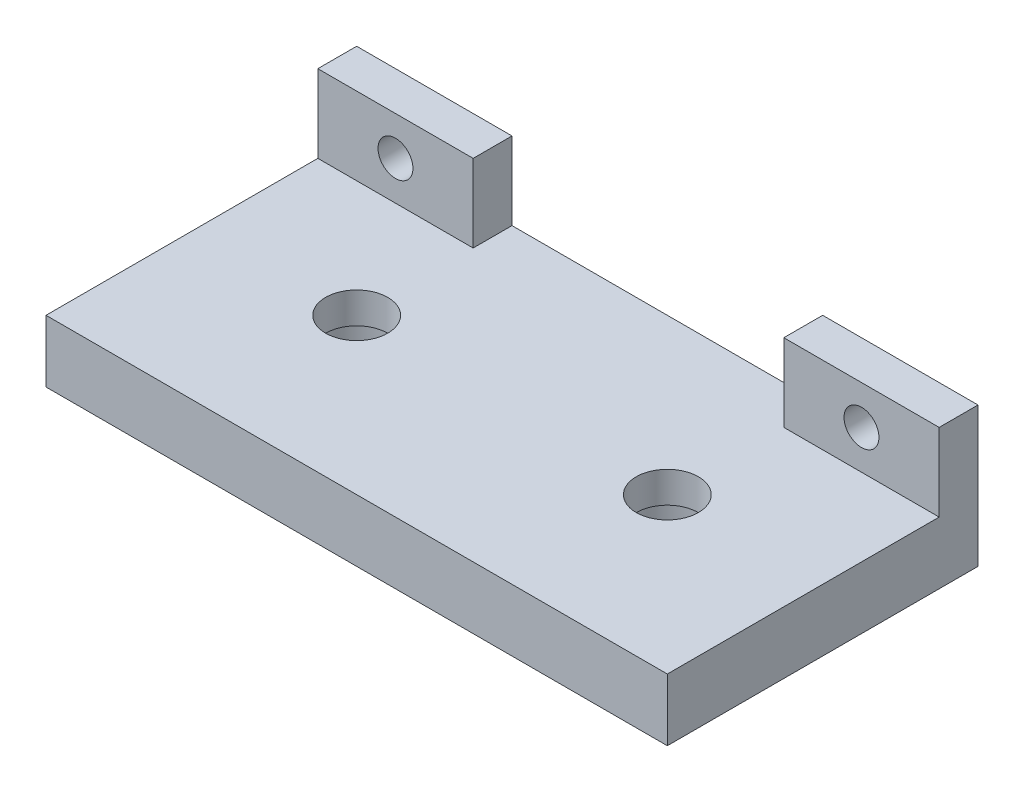
ISO-10303-21;
HEADER;
FILE_DESCRIPTION(('STEP AP214'),'2;1');
FILE_NAME('part.step','',(''),(''),'','','');
FILE_SCHEMA(('AUTOMOTIVE_DESIGN { 1 0 10303 214 1 1 1 1 }'));
ENDSEC;
DATA;
#1=APPLICATION_CONTEXT('core data for automotive mechanical design processes');
#2=APPLICATION_PROTOCOL_DEFINITION('international standard','automotive_design',2000,#1);
#3=PRODUCT_CONTEXT('',#1,'mechanical');
#4=PRODUCT('Part','Part','',(#3));
#5=PRODUCT_RELATED_PRODUCT_CATEGORY('part','',(#4));
#6=PRODUCT_DEFINITION_FORMATION('','',#4);
#7=PRODUCT_DEFINITION_CONTEXT('part definition',#1,'design');
#8=PRODUCT_DEFINITION('design','',#6,#7);
#9=PRODUCT_DEFINITION_SHAPE('','',#8);
#10=(LENGTH_UNIT() NAMED_UNIT(*) SI_UNIT(.MILLI.,.METRE.));
#11=(NAMED_UNIT(*) PLANE_ANGLE_UNIT() SI_UNIT($,.RADIAN.));
#12=(NAMED_UNIT(*) SI_UNIT($,.STERADIAN.) SOLID_ANGLE_UNIT());
#13=UNCERTAINTY_MEASURE_WITH_UNIT(LENGTH_MEASURE(1.E-05),#10,'distance_accuracy_value','');
#14=(GEOMETRIC_REPRESENTATION_CONTEXT(3) GLOBAL_UNCERTAINTY_ASSIGNED_CONTEXT((#13)) GLOBAL_UNIT_ASSIGNED_CONTEXT((#10,
#11,#12)) REPRESENTATION_CONTEXT('',''));
#15=CARTESIAN_POINT('',(0.,0.,0.));
#16=DIRECTION('',(0.,0.,1.));
#17=DIRECTION('',(1.,0.,0.));
#18=AXIS2_PLACEMENT_3D('',#15,#16,#17);
#19=CARTESIAN_POINT('',(0.,8.,0.));
#20=DIRECTION('',(0.,-1.,0.));
#21=DIRECTION('',(0.,0.,-1.));
#22=AXIS2_PLACEMENT_3D('',#19,#20,#21);
#23=PLANE('',#22);
#24=CARTESIAN_POINT('',(19.7973976444563,8.,13.3384584942213));
#25=DIRECTION('',(0.,1.,0.));
#26=DIRECTION('',(0.,0.,1.));
#27=AXIS2_PLACEMENT_3D('',#24,#25,#26);
#28=CIRCLE('',#27,4.00000000000001);
#29=CARTESIAN_POINT('',(19.7973976444563,8.,17.3384584942213));
#30=VERTEX_POINT('',#29);
#31=EDGE_CURVE('E167',#30,#30,#28,.T.);
#32=ORIENTED_EDGE('',*,*,#31,.F.);
#33=EDGE_LOOP('',(#32));
#34=FACE_BOUND('',#33,.T.);
#35=CARTESIAN_POINT('',(-20.2026023555437,8.,13.3384584942213));
#36=DIRECTION('',(0.,1.,0.));
#37=DIRECTION('',(0.,0.,1.));
#38=AXIS2_PLACEMENT_3D('',#35,#36,#37);
#39=CIRCLE('',#38,4.);
#40=CARTESIAN_POINT('',(-20.2026023555437,8.,17.3384584942213));
#41=VERTEX_POINT('',#40);
#42=EDGE_CURVE('E161',#41,#41,#39,.T.);
#43=ORIENTED_EDGE('',*,*,#42,.F.);
#44=EDGE_LOOP('',(#43));
#45=FACE_BOUND('',#44,.T.);
#46=DIRECTION('',(0.,0.,-1.));
#47=VECTOR('',#46,1.);
#48=CARTESIAN_POINT('',(-20.2026023555437,8.,-1.66154150577874));
#49=LINE('',#48,#47);
#50=CARTESIAN_POINT('',(-20.2026023555437,8.,-1.66154150577874));
#51=VERTEX_POINT('',#50);
#52=CARTESIAN_POINT('',(-20.2026023555437,8.,-6.66154150577874));
#53=VERTEX_POINT('',#52);
#54=EDGE_CURVE('E48',#51,#53,#49,.T.);
#55=ORIENTED_EDGE('',*,*,#54,.F.);
#56=DIRECTION('',(1.,0.,0.));
#57=VECTOR('',#56,1.);
#58=CARTESIAN_POINT('',(-20.2026023555437,8.,-1.66154150577874));
#59=LINE('',#58,#57);
#60=CARTESIAN_POINT('',(-40.2026023555437,8.,-1.66154150577874));
#61=VERTEX_POINT('',#60);
#62=EDGE_CURVE('E52',#61,#51,#59,.T.);
#63=ORIENTED_EDGE('',*,*,#62,.F.);
#64=DIRECTION('',(0.,0.,1.));
#65=VECTOR('',#64,1.);
#66=CARTESIAN_POINT('',(-40.2026023555437,8.,33.3384584942213));
#67=LINE('',#66,#65);
#68=CARTESIAN_POINT('',(-40.2026023555437,8.,33.3384584942213));
#69=VERTEX_POINT('',#68);
#70=EDGE_CURVE('E175',#61,#69,#67,.T.);
#71=ORIENTED_EDGE('',*,*,#70,.T.);
#72=DIRECTION('',(1.,0.,0.));
#73=VECTOR('',#72,1.);
#74=CARTESIAN_POINT('',(-40.2026023555437,8.,33.3384584942213));
#75=LINE('',#74,#73);
#76=CARTESIAN_POINT('',(39.7973976444563,8.,33.3384584942213));
#77=VERTEX_POINT('',#76);
#78=EDGE_CURVE('E177',#69,#77,#75,.T.);
#79=ORIENTED_EDGE('',*,*,#78,.T.);
#80=DIRECTION('',(0.,0.,-1.));
#81=VECTOR('',#80,1.);
#82=CARTESIAN_POINT('',(39.7973976444563,8.,33.3384584942213));
#83=LINE('',#82,#81);
#84=CARTESIAN_POINT('',(39.7973976444563,8.,-1.66154150577874));
#85=VERTEX_POINT('',#84);
#86=EDGE_CURVE('E180',#77,#85,#83,.T.);
#87=ORIENTED_EDGE('',*,*,#86,.T.);
#88=DIRECTION('',(1.,0.,0.));
#89=VECTOR('',#88,1.);
#90=CARTESIAN_POINT('',(39.7973976444563,8.,-1.66154150577874));
#91=LINE('',#90,#89);
#92=CARTESIAN_POINT('',(19.7973976444563,8.,-1.66154150577874));
#93=VERTEX_POINT('',#92);
#94=EDGE_CURVE('E134',#93,#85,#91,.T.);
#95=ORIENTED_EDGE('',*,*,#94,.F.);
#96=DIRECTION('',(0.,0.,1.));
#97=VECTOR('',#96,1.);
#98=CARTESIAN_POINT('',(19.7973976444563,8.,-1.66154150577874));
#99=LINE('',#98,#97);
#100=CARTESIAN_POINT('',(19.7973976444563,8.,-6.66154150577874));
#101=VERTEX_POINT('',#100);
#102=EDGE_CURVE('E130',#101,#93,#99,.T.);
#103=ORIENTED_EDGE('',*,*,#102,.F.);
#104=DIRECTION('',(-1.,0.,0.));
#105=VECTOR('',#104,1.);
#106=CARTESIAN_POINT('',(-40.2026023555437,8.,-6.66154150577874));
#107=LINE('',#106,#105);
#108=EDGE_CURVE('E182',#101,#53,#107,.T.);
#109=ORIENTED_EDGE('',*,*,#108,.T.);
#110=EDGE_LOOP('',(#55,#63,#71,#79,#87,#95,#103,#109));
#111=FACE_BOUND('',#110,.T.);
#112=ADVANCED_FACE('F33',(#34,#45,#111),#23,.F.);
#113=CARTESIAN_POINT('',(-40.2026023555437,8.,33.3384584942213));
#114=DIRECTION('',(1.,0.,0.));
#115=DIRECTION('',(0.,0.,-1.));
#116=AXIS2_PLACEMENT_3D('',#113,#114,#115);
#117=PLANE('',#116);
#118=DIRECTION('',(0.,0.,1.));
#119=VECTOR('',#118,1.);
#120=CARTESIAN_POINT('',(-40.2026023555437,0.,33.3384584942213));
#121=LINE('',#120,#119);
#122=CARTESIAN_POINT('',(-40.2026023555437,0.,-6.66154150577874));
#123=VERTEX_POINT('',#122);
#124=CARTESIAN_POINT('',(-40.2026023555437,0.,33.3384584942213));
#125=VERTEX_POINT('',#124);
#126=EDGE_CURVE('E170',#123,#125,#121,.T.);
#127=ORIENTED_EDGE('',*,*,#126,.T.);
#128=DIRECTION('',(0.,-1.,0.));
#129=VECTOR('',#128,1.);
#130=CARTESIAN_POINT('',(-40.2026023555437,8.,33.3384584942213));
#131=LINE('',#130,#129);
#132=EDGE_CURVE('E11',#69,#125,#131,.T.);
#133=ORIENTED_EDGE('',*,*,#132,.F.);
#134=ORIENTED_EDGE('',*,*,#70,.F.);
#135=DIRECTION('',(0.,-1.,0.));
#136=VECTOR('',#135,1.);
#137=CARTESIAN_POINT('',(-40.2026023555437,18.,-1.66154150577874));
#138=LINE('',#137,#136);
#139=CARTESIAN_POINT('',(-40.2026023555437,18.,-1.66154150577874));
#140=VERTEX_POINT('',#139);
#141=EDGE_CURVE('E131',#140,#61,#138,.T.);
#142=ORIENTED_EDGE('',*,*,#141,.F.);
#143=DIRECTION('',(0.,0.,1.));
#144=VECTOR('',#143,1.);
#145=CARTESIAN_POINT('',(-40.2026023555437,18.,-1.66154150577874));
#146=LINE('',#145,#144);
#147=CARTESIAN_POINT('',(-40.2026023555437,18.,-6.66154150577874));
#148=VERTEX_POINT('',#147);
#149=EDGE_CURVE('E118',#148,#140,#146,.T.);
#150=ORIENTED_EDGE('',*,*,#149,.F.);
#151=DIRECTION('',(0.,-1.,0.));
#152=VECTOR('',#151,1.);
#153=CARTESIAN_POINT('',(-40.2026023555437,8.,-6.66154150577874));
#154=LINE('',#153,#152);
#155=EDGE_CURVE('E115',#148,#123,#154,.T.);
#156=ORIENTED_EDGE('',*,*,#155,.T.);
#157=EDGE_LOOP('',(#127,#133,#134,#142,#150,#156));
#158=FACE_BOUND('',#157,.T.);
#159=ADVANCED_FACE('F35',(#158),#117,.F.);
#160=CARTESIAN_POINT('',(-40.2026023555437,8.,33.3384584942213));
#161=DIRECTION('',(0.,0.,-1.));
#162=DIRECTION('',(-1.,0.,0.));
#163=AXIS2_PLACEMENT_3D('',#160,#161,#162);
#164=PLANE('',#163);
#165=DIRECTION('',(1.,0.,0.));
#166=VECTOR('',#165,1.);
#167=CARTESIAN_POINT('',(-40.2026023555437,0.,33.3384584942213));
#168=LINE('',#167,#166);
#169=CARTESIAN_POINT('',(39.7973976444563,0.,33.3384584942213));
#170=VERTEX_POINT('',#169);
#171=EDGE_CURVE('E186',#125,#170,#168,.T.);
#172=ORIENTED_EDGE('',*,*,#171,.T.);
#173=DIRECTION('',(0.,-1.,0.));
#174=VECTOR('',#173,1.);
#175=CARTESIAN_POINT('',(39.7973976444563,8.,33.3384584942213));
#176=LINE('',#175,#174);
#177=EDGE_CURVE('E41',#77,#170,#176,.T.);
#178=ORIENTED_EDGE('',*,*,#177,.F.);
#179=ORIENTED_EDGE('',*,*,#78,.F.);
#180=ORIENTED_EDGE('',*,*,#132,.T.);
#181=EDGE_LOOP('',(#172,#178,#179,#180));
#182=FACE_BOUND('',#181,.T.);
#183=ADVANCED_FACE('F234',(#182),#164,.F.);
#184=CARTESIAN_POINT('',(39.7973976444563,8.,33.3384584942213));
#185=DIRECTION('',(-1.,0.,0.));
#186=DIRECTION('',(0.,0.,1.));
#187=AXIS2_PLACEMENT_3D('',#184,#185,#186);
#188=PLANE('',#187);
#189=DIRECTION('',(0.,0.,-1.));
#190=VECTOR('',#189,1.);
#191=CARTESIAN_POINT('',(39.7973976444563,0.,33.3384584942213));
#192=LINE('',#191,#190);
#193=CARTESIAN_POINT('',(39.7973976444563,0.,-6.66154150577874));
#194=VERTEX_POINT('',#193);
#195=EDGE_CURVE('E188',#170,#194,#192,.T.);
#196=ORIENTED_EDGE('',*,*,#195,.T.);
#197=DIRECTION('',(0.,-1.,0.));
#198=VECTOR('',#197,1.);
#199=CARTESIAN_POINT('',(39.7973976444563,8.,-6.66154150577874));
#200=LINE('',#199,#198);
#201=CARTESIAN_POINT('',(39.7973976444563,18.,-6.66154150577874));
#202=VERTEX_POINT('',#201);
#203=EDGE_CURVE('E192',#202,#194,#200,.T.);
#204=ORIENTED_EDGE('',*,*,#203,.F.);
#205=DIRECTION('',(0.,0.,-1.));
#206=VECTOR('',#205,1.);
#207=CARTESIAN_POINT('',(39.7973976444563,18.,-1.66154150577874));
#208=LINE('',#207,#206);
#209=CARTESIAN_POINT('',(39.7973976444563,18.,-1.66154150577874));
#210=VERTEX_POINT('',#209);
#211=EDGE_CURVE('E141',#210,#202,#208,.T.);
#212=ORIENTED_EDGE('',*,*,#211,.F.);
#213=DIRECTION('',(0.,-1.,0.));
#214=VECTOR('',#213,1.);
#215=CARTESIAN_POINT('',(39.7973976444563,18.,-1.66154150577874));
#216=LINE('',#215,#214);
#217=EDGE_CURVE('E149',#210,#85,#216,.T.);
#218=ORIENTED_EDGE('',*,*,#217,.T.);
#219=ORIENTED_EDGE('',*,*,#86,.F.);
#220=ORIENTED_EDGE('',*,*,#177,.T.);
#221=EDGE_LOOP('',(#196,#204,#212,#218,#219,#220));
#222=FACE_BOUND('',#221,.T.);
#223=ADVANCED_FACE('F199',(#222),#188,.F.);
#224=CARTESIAN_POINT('',(-40.2026023555437,8.,-6.66154150577874));
#225=DIRECTION('',(0.,0.,1.));
#226=DIRECTION('',(1.,0.,0.));
#227=AXIS2_PLACEMENT_3D('',#224,#225,#226);
#228=PLANE('',#227);
#229=CARTESIAN_POINT('',(29.7973976444563,13.,-6.66154150577874));
#230=DIRECTION('',(0.,0.,-1.));
#231=DIRECTION('',(-1.,0.,0.));
#232=AXIS2_PLACEMENT_3D('',#229,#230,#231);
#233=CIRCLE('',#232,2.2479);
#234=CARTESIAN_POINT('',(27.5494976444563,13.,-6.66154150577874));
#235=VERTEX_POINT('',#234);
#236=EDGE_CURVE('E382',#235,#235,#233,.T.);
#237=ORIENTED_EDGE('',*,*,#236,.F.);
#238=EDGE_LOOP('',(#237));
#239=FACE_BOUND('',#238,.T.);
#240=CARTESIAN_POINT('',(-30.2026023555437,13.,-6.66154150577874));
#241=DIRECTION('',(0.,0.,-1.));
#242=DIRECTION('',(-1.,0.,0.));
#243=AXIS2_PLACEMENT_3D('',#240,#241,#242);
#244=CIRCLE('',#243,2.2479);
#245=CARTESIAN_POINT('',(-32.4505023555437,13.,-6.66154150577874));
#246=VERTEX_POINT('',#245);
#247=EDGE_CURVE('E384',#246,#246,#244,.T.);
#248=ORIENTED_EDGE('',*,*,#247,.F.);
#249=EDGE_LOOP('',(#248));
#250=FACE_BOUND('',#249,.T.);
#251=DIRECTION('',(-1.,0.,0.));
#252=VECTOR('',#251,1.);
#253=CARTESIAN_POINT('',(-40.2026023555437,0.,-6.66154150577874));
#254=LINE('',#253,#252);
#255=EDGE_CURVE('E178',#194,#123,#254,.T.);
#256=ORIENTED_EDGE('',*,*,#255,.T.);
#257=ORIENTED_EDGE('',*,*,#155,.F.);
#258=DIRECTION('',(-1.,0.,0.));
#259=VECTOR('',#258,1.);
#260=CARTESIAN_POINT('',(-20.2026023555437,18.,-6.66154150577874));
#261=LINE('',#260,#259);
#262=CARTESIAN_POINT('',(-20.2026023555437,18.,-6.66154150577874));
#263=VERTEX_POINT('',#262);
#264=EDGE_CURVE('E108',#263,#148,#261,.T.);
#265=ORIENTED_EDGE('',*,*,#264,.F.);
#266=DIRECTION('',(0.,-1.,0.));
#267=VECTOR('',#266,1.);
#268=CARTESIAN_POINT('',(-20.2026023555437,18.,-6.66154150577874));
#269=LINE('',#268,#267);
#270=EDGE_CURVE('E113',#263,#53,#269,.T.);
#271=ORIENTED_EDGE('',*,*,#270,.T.);
#272=ORIENTED_EDGE('',*,*,#108,.F.);
#273=DIRECTION('',(0.,-1.,0.));
#274=VECTOR('',#273,1.);
#275=CARTESIAN_POINT('',(19.7973976444563,18.,-6.66154150577874));
#276=LINE('',#275,#274);
#277=CARTESIAN_POINT('',(19.7973976444563,18.,-6.66154150577874));
#278=VERTEX_POINT('',#277);
#279=EDGE_CURVE('E158',#278,#101,#276,.T.);
#280=ORIENTED_EDGE('',*,*,#279,.F.);
#281=DIRECTION('',(-1.,0.,0.));
#282=VECTOR('',#281,1.);
#283=CARTESIAN_POINT('',(39.7973976444563,18.,-6.66154150577874));
#284=LINE('',#283,#282);
#285=EDGE_CURVE('E144',#202,#278,#284,.T.);
#286=ORIENTED_EDGE('',*,*,#285,.F.);
#287=ORIENTED_EDGE('',*,*,#203,.T.);
#288=EDGE_LOOP('',(#256,#257,#265,#271,#272,#280,#286,#287));
#289=FACE_BOUND('',#288,.T.);
#290=ADVANCED_FACE('F110',(#239,#250,#289),#228,.F.);
#291=CARTESIAN_POINT('',(0.,0.,0.));
#292=DIRECTION('',(0.,-1.,0.));
#293=DIRECTION('',(0.,0.,-1.));
#294=AXIS2_PLACEMENT_3D('',#291,#292,#293);
#295=PLANE('',#294);
#296=CARTESIAN_POINT('',(-20.2026023555437,0.,13.3384584942213));
#297=DIRECTION('',(0.,-1.,0.));
#298=DIRECTION('',(0.,0.,-1.));
#299=AXIS2_PLACEMENT_3D('',#296,#297,#298);
#300=CIRCLE('',#299,5.75);
#301=CARTESIAN_POINT('',(-20.2026023555437,0.,7.58845849422126));
#302=VERTEX_POINT('',#301);
#303=EDGE_CURVE('E394',#302,#302,#300,.T.);
#304=ORIENTED_EDGE('',*,*,#303,.F.);
#305=EDGE_LOOP('',(#304));
#306=FACE_BOUND('',#305,.T.);
#307=CARTESIAN_POINT('',(19.7973976444563,0.,13.3384584942213));
#308=DIRECTION('',(0.,-1.,0.));
#309=DIRECTION('',(0.,0.,-1.));
#310=AXIS2_PLACEMENT_3D('',#307,#308,#309);
#311=CIRCLE('',#310,5.75);
#312=CARTESIAN_POINT('',(19.7973976444563,0.,7.58845849422126));
#313=VERTEX_POINT('',#312);
#314=EDGE_CURVE('E391',#313,#313,#311,.T.);
#315=ORIENTED_EDGE('',*,*,#314,.F.);
#316=EDGE_LOOP('',(#315));
#317=FACE_BOUND('',#316,.T.);
#318=ORIENTED_EDGE('',*,*,#126,.F.);
#319=ORIENTED_EDGE('',*,*,#255,.F.);
#320=ORIENTED_EDGE('',*,*,#195,.F.);
#321=ORIENTED_EDGE('',*,*,#171,.F.);
#322=EDGE_LOOP('',(#318,#319,#320,#321));
#323=FACE_BOUND('',#322,.T.);
#324=ADVANCED_FACE('F205',(#306,#317,#323),#295,.T.);
#325=CARTESIAN_POINT('',(-20.2026023555437,4.,13.3384584942213));
#326=DIRECTION('',(0.,1.,0.));
#327=DIRECTION('',(0.,0.,1.));
#328=AXIS2_PLACEMENT_3D('',#325,#326,#327);
#329=CYLINDRICAL_SURFACE('',#328,4.);
#330=CARTESIAN_POINT('',(-20.2026023555437,4.,13.3384584942213));
#331=DIRECTION('',(0.,1.,0.));
#332=DIRECTION('',(0.,0.,1.));
#333=AXIS2_PLACEMENT_3D('',#330,#331,#332);
#334=CIRCLE('',#333,4.);
#335=CARTESIAN_POINT('',(-20.2026023555437,4.,17.3384584942213));
#336=VERTEX_POINT('',#335);
#337=EDGE_CURVE('E165',#336,#336,#334,.T.);
#338=ORIENTED_EDGE('',*,*,#337,.F.);
#339=EDGE_LOOP('',(#338));
#340=FACE_BOUND('',#339,.T.);
#341=ORIENTED_EDGE('',*,*,#42,.T.);
#342=EDGE_LOOP('',(#341));
#343=FACE_BOUND('',#342,.T.);
#344=ADVANCED_FACE('F239',(#340,#343),#329,.F.);
#345=CARTESIAN_POINT('',(19.7973976444563,4.,13.3384584942213));
#346=DIRECTION('',(0.,1.,0.));
#347=DIRECTION('',(0.,0.,1.));
#348=AXIS2_PLACEMENT_3D('',#345,#346,#347);
#349=CYLINDRICAL_SURFACE('',#348,4.00000000000001);
#350=CARTESIAN_POINT('',(19.7973976444563,4.,13.3384584942213));
#351=DIRECTION('',(0.,1.,0.));
#352=DIRECTION('',(0.,0.,1.));
#353=AXIS2_PLACEMENT_3D('',#350,#351,#352);
#354=CIRCLE('',#353,4.00000000000001);
#355=CARTESIAN_POINT('',(19.7973976444563,4.,17.3384584942213));
#356=VERTEX_POINT('',#355);
#357=EDGE_CURVE('E162',#356,#356,#354,.T.);
#358=ORIENTED_EDGE('',*,*,#357,.F.);
#359=EDGE_LOOP('',(#358));
#360=FACE_BOUND('',#359,.T.);
#361=ORIENTED_EDGE('',*,*,#31,.T.);
#362=EDGE_LOOP('',(#361));
#363=FACE_BOUND('',#362,.T.);
#364=ADVANCED_FACE('F263',(#360,#363),#349,.F.);
#365=CARTESIAN_POINT('',(19.7973976444563,18.,-1.66154150577874));
#366=DIRECTION('',(1.,0.,0.));
#367=DIRECTION('',(0.,0.,-1.));
#368=AXIS2_PLACEMENT_3D('',#365,#366,#367);
#369=PLANE('',#368);
#370=ORIENTED_EDGE('',*,*,#102,.T.);
#371=DIRECTION('',(0.,-1.,0.));
#372=VECTOR('',#371,1.);
#373=CARTESIAN_POINT('',(19.7973976444563,18.,-1.66154150577874));
#374=LINE('',#373,#372);
#375=CARTESIAN_POINT('',(19.7973976444563,18.,-1.66154150577874));
#376=VERTEX_POINT('',#375);
#377=EDGE_CURVE('E155',#376,#93,#374,.T.);
#378=ORIENTED_EDGE('',*,*,#377,.F.);
#379=DIRECTION('',(0.,0.,1.));
#380=VECTOR('',#379,1.);
#381=CARTESIAN_POINT('',(19.7973976444563,18.,-1.66154150577874));
#382=LINE('',#381,#380);
#383=EDGE_CURVE('E146',#278,#376,#382,.T.);
#384=ORIENTED_EDGE('',*,*,#383,.F.);
#385=ORIENTED_EDGE('',*,*,#279,.T.);
#386=EDGE_LOOP('',(#370,#378,#384,#385));
#387=FACE_BOUND('',#386,.T.);
#388=ADVANCED_FACE('F261',(#387),#369,.F.);
#389=CARTESIAN_POINT('',(39.7973976444563,18.,-1.66154150577874));
#390=DIRECTION('',(0.,0.,-1.));
#391=DIRECTION('',(-1.,0.,0.));
#392=AXIS2_PLACEMENT_3D('',#389,#390,#391);
#393=PLANE('',#392);
#394=CARTESIAN_POINT('',(29.7973976444563,13.,-1.66154150577874));
#395=DIRECTION('',(0.,0.,-1.));
#396=DIRECTION('',(-1.,0.,0.));
#397=AXIS2_PLACEMENT_3D('',#394,#395,#396);
#398=CIRCLE('',#397,2.2479);
#399=CARTESIAN_POINT('',(27.5494976444563,13.,-1.66154150577874));
#400=VERTEX_POINT('',#399);
#401=EDGE_CURVE('E379',#400,#400,#398,.T.);
#402=ORIENTED_EDGE('',*,*,#401,.T.);
#403=EDGE_LOOP('',(#402));
#404=FACE_BOUND('',#403,.T.);
#405=ORIENTED_EDGE('',*,*,#94,.T.);
#406=ORIENTED_EDGE('',*,*,#217,.F.);
#407=DIRECTION('',(1.,0.,0.));
#408=VECTOR('',#407,1.);
#409=CARTESIAN_POINT('',(39.7973976444563,18.,-1.66154150577874));
#410=LINE('',#409,#408);
#411=EDGE_CURVE('E148',#376,#210,#410,.T.);
#412=ORIENTED_EDGE('',*,*,#411,.F.);
#413=ORIENTED_EDGE('',*,*,#377,.T.);
#414=EDGE_LOOP('',(#405,#406,#412,#413));
#415=FACE_BOUND('',#414,.T.);
#416=ADVANCED_FACE('F253',(#404,#415),#393,.F.);
#417=CARTESIAN_POINT('',(0.,18.,0.));
#418=DIRECTION('',(0.,1.,0.));
#419=DIRECTION('',(0.,0.,1.));
#420=AXIS2_PLACEMENT_3D('',#417,#418,#419);
#421=PLANE('',#420);
#422=ORIENTED_EDGE('',*,*,#211,.T.);
#423=ORIENTED_EDGE('',*,*,#285,.T.);
#424=ORIENTED_EDGE('',*,*,#383,.T.);
#425=ORIENTED_EDGE('',*,*,#411,.T.);
#426=EDGE_LOOP('',(#422,#423,#424,#425));
#427=FACE_BOUND('',#426,.T.);
#428=ADVANCED_FACE('F225',(#427),#421,.T.);
#429=CARTESIAN_POINT('',(-20.2026023555437,18.,-1.66154150577874));
#430=DIRECTION('',(-1.,0.,0.));
#431=DIRECTION('',(0.,0.,1.));
#432=AXIS2_PLACEMENT_3D('',#429,#430,#431);
#433=PLANE('',#432);
#434=ORIENTED_EDGE('',*,*,#54,.T.);
#435=ORIENTED_EDGE('',*,*,#270,.F.);
#436=DIRECTION('',(0.,0.,-1.));
#437=VECTOR('',#436,1.);
#438=CARTESIAN_POINT('',(-20.2026023555437,18.,-1.66154150577874));
#439=LINE('',#438,#437);
#440=CARTESIAN_POINT('',(-20.2026023555437,18.,-1.66154150577874));
#441=VERTEX_POINT('',#440);
#442=EDGE_CURVE('E119',#441,#263,#439,.T.);
#443=ORIENTED_EDGE('',*,*,#442,.F.);
#444=DIRECTION('',(0.,-1.,0.));
#445=VECTOR('',#444,1.);
#446=CARTESIAN_POINT('',(-20.2026023555437,18.,-1.66154150577874));
#447=LINE('',#446,#445);
#448=EDGE_CURVE('E137',#441,#51,#447,.T.);
#449=ORIENTED_EDGE('',*,*,#448,.T.);
#450=EDGE_LOOP('',(#434,#435,#443,#449));
#451=FACE_BOUND('',#450,.T.);
#452=ADVANCED_FACE('F129',(#451),#433,.F.);
#453=CARTESIAN_POINT('',(-20.2026023555437,18.,-1.66154150577874));
#454=DIRECTION('',(0.,0.,-1.));
#455=DIRECTION('',(-1.,0.,0.));
#456=AXIS2_PLACEMENT_3D('',#453,#454,#455);
#457=PLANE('',#456);
#458=CARTESIAN_POINT('',(-30.2026023555437,13.,-1.66154150577874));
#459=DIRECTION('',(0.,0.,-1.));
#460=DIRECTION('',(-1.,0.,0.));
#461=AXIS2_PLACEMENT_3D('',#458,#459,#460);
#462=CIRCLE('',#461,2.2479);
#463=CARTESIAN_POINT('',(-32.4505023555437,13.,-1.66154150577874));
#464=VERTEX_POINT('',#463);
#465=EDGE_CURVE('E389',#464,#464,#462,.T.);
#466=ORIENTED_EDGE('',*,*,#465,.T.);
#467=EDGE_LOOP('',(#466));
#468=FACE_BOUND('',#467,.T.);
#469=ORIENTED_EDGE('',*,*,#62,.T.);
#470=ORIENTED_EDGE('',*,*,#448,.F.);
#471=DIRECTION('',(1.,0.,0.));
#472=VECTOR('',#471,1.);
#473=CARTESIAN_POINT('',(-20.2026023555437,18.,-1.66154150577874));
#474=LINE('',#473,#472);
#475=EDGE_CURVE('E124',#140,#441,#474,.T.);
#476=ORIENTED_EDGE('',*,*,#475,.F.);
#477=ORIENTED_EDGE('',*,*,#141,.T.);
#478=EDGE_LOOP('',(#469,#470,#476,#477));
#479=FACE_BOUND('',#478,.T.);
#480=ADVANCED_FACE('F215',(#468,#479),#457,.F.);
#481=CARTESIAN_POINT('',(0.,18.,0.));
#482=DIRECTION('',(0.,1.,0.));
#483=DIRECTION('',(0.,0.,1.));
#484=AXIS2_PLACEMENT_3D('',#481,#482,#483);
#485=PLANE('',#484);
#486=ORIENTED_EDGE('',*,*,#442,.T.);
#487=ORIENTED_EDGE('',*,*,#264,.T.);
#488=ORIENTED_EDGE('',*,*,#149,.T.);
#489=ORIENTED_EDGE('',*,*,#475,.T.);
#490=EDGE_LOOP('',(#486,#487,#488,#489));
#491=FACE_BOUND('',#490,.T.);
#492=ADVANCED_FACE('F122',(#491),#485,.T.);
#493=CARTESIAN_POINT('',(19.7973976444563,4.,13.3384584942213));
#494=DIRECTION('',(0.,-1.,0.));
#495=DIRECTION('',(0.,0.,-1.));
#496=AXIS2_PLACEMENT_3D('',#493,#494,#495);
#497=PLANE('',#496);
#498=CARTESIAN_POINT('',(19.7973976444563,4.,13.3384584942213));
#499=DIRECTION('',(0.,-1.,0.));
#500=DIRECTION('',(0.,0.,-1.));
#501=AXIS2_PLACEMENT_3D('',#498,#499,#500);
#502=CIRCLE('',#501,5.75);
#503=CARTESIAN_POINT('',(19.7973976444563,4.,7.58845849422126));
#504=VERTEX_POINT('',#503);
#505=EDGE_CURVE('E397',#504,#504,#502,.T.);
#506=ORIENTED_EDGE('',*,*,#505,.T.);
#507=EDGE_LOOP('',(#506));
#508=FACE_BOUND('',#507,.T.);
#509=ORIENTED_EDGE('',*,*,#357,.T.);
#510=EDGE_LOOP('',(#509));
#511=FACE_BOUND('',#510,.T.);
#512=ADVANCED_FACE('F223',(#508,#511),#497,.T.);
#513=CARTESIAN_POINT('',(19.7973976444563,4.,13.3384584942213));
#514=DIRECTION('',(0.,-1.,0.));
#515=DIRECTION('',(0.,0.,-1.));
#516=AXIS2_PLACEMENT_3D('',#513,#514,#515);
#517=CYLINDRICAL_SURFACE('',#516,5.75);
#518=ORIENTED_EDGE('',*,*,#505,.F.);
#519=EDGE_LOOP('',(#518));
#520=FACE_BOUND('',#519,.T.);
#521=ORIENTED_EDGE('',*,*,#314,.T.);
#522=EDGE_LOOP('',(#521));
#523=FACE_BOUND('',#522,.T.);
#524=ADVANCED_FACE('F307',(#520,#523),#517,.F.);
#525=CARTESIAN_POINT('',(-20.2026023555437,4.,13.3384584942213));
#526=DIRECTION('',(0.,-1.,0.));
#527=DIRECTION('',(0.,0.,-1.));
#528=AXIS2_PLACEMENT_3D('',#525,#526,#527);
#529=PLANE('',#528);
#530=CARTESIAN_POINT('',(-20.2026023555437,4.,13.3384584942213));
#531=DIRECTION('',(0.,-1.,0.));
#532=DIRECTION('',(0.,0.,-1.));
#533=AXIS2_PLACEMENT_3D('',#530,#531,#532);
#534=CIRCLE('',#533,5.75);
#535=CARTESIAN_POINT('',(-20.2026023555437,4.,7.58845849422126));
#536=VERTEX_POINT('',#535);
#537=EDGE_CURVE('E166',#536,#536,#534,.T.);
#538=ORIENTED_EDGE('',*,*,#537,.T.);
#539=EDGE_LOOP('',(#538));
#540=FACE_BOUND('',#539,.T.);
#541=ORIENTED_EDGE('',*,*,#337,.T.);
#542=EDGE_LOOP('',(#541));
#543=FACE_BOUND('',#542,.T.);
#544=ADVANCED_FACE('F317',(#540,#543),#529,.T.);
#545=CARTESIAN_POINT('',(-20.2026023555437,4.,13.3384584942213));
#546=DIRECTION('',(0.,-1.,0.));
#547=DIRECTION('',(0.,0.,-1.));
#548=AXIS2_PLACEMENT_3D('',#545,#546,#547);
#549=CYLINDRICAL_SURFACE('',#548,5.75);
#550=ORIENTED_EDGE('',*,*,#537,.F.);
#551=EDGE_LOOP('',(#550));
#552=FACE_BOUND('',#551,.T.);
#553=ORIENTED_EDGE('',*,*,#303,.T.);
#554=EDGE_LOOP('',(#553));
#555=FACE_BOUND('',#554,.T.);
#556=ADVANCED_FACE('F327',(#552,#555),#549,.F.);
#557=CARTESIAN_POINT('',(-30.2026023555437,13.,-6.66154150577874));
#558=DIRECTION('',(0.,0.,-1.));
#559=DIRECTION('',(-1.,0.,0.));
#560=AXIS2_PLACEMENT_3D('',#557,#558,#559);
#561=CYLINDRICAL_SURFACE('',#560,2.2479);
#562=ORIENTED_EDGE('',*,*,#465,.F.);
#563=EDGE_LOOP('',(#562));
#564=FACE_BOUND('',#563,.T.);
#565=ORIENTED_EDGE('',*,*,#247,.T.);
#566=EDGE_LOOP('',(#565));
#567=FACE_BOUND('',#566,.T.);
#568=ADVANCED_FACE('F337',(#564,#567),#561,.F.);
#569=CARTESIAN_POINT('',(29.7973976444563,13.,-6.66154150577874));
#570=DIRECTION('',(0.,0.,-1.));
#571=DIRECTION('',(-1.,0.,0.));
#572=AXIS2_PLACEMENT_3D('',#569,#570,#571);
#573=CYLINDRICAL_SURFACE('',#572,2.2479);
#574=ORIENTED_EDGE('',*,*,#401,.F.);
#575=EDGE_LOOP('',(#574));
#576=FACE_BOUND('',#575,.T.);
#577=ORIENTED_EDGE('',*,*,#236,.T.);
#578=EDGE_LOOP('',(#577));
#579=FACE_BOUND('',#578,.T.);
#580=ADVANCED_FACE('F362',(#576,#579),#573,.F.);
#581=CLOSED_SHELL('',(#112,#159,#183,#223,#290,#324,#344,#364,#388,#416,#428,#452,#480,#492,
#512,#524,#544,#556,#568,#580));
#582=MANIFOLD_SOLID_BREP('B2',#581);
#583=ADVANCED_BREP_SHAPE_REPRESENTATION('',(#18,#582),#14);
#584=SHAPE_DEFINITION_REPRESENTATION(#9,#583);
ENDSEC;
END-ISO-10303-21;
